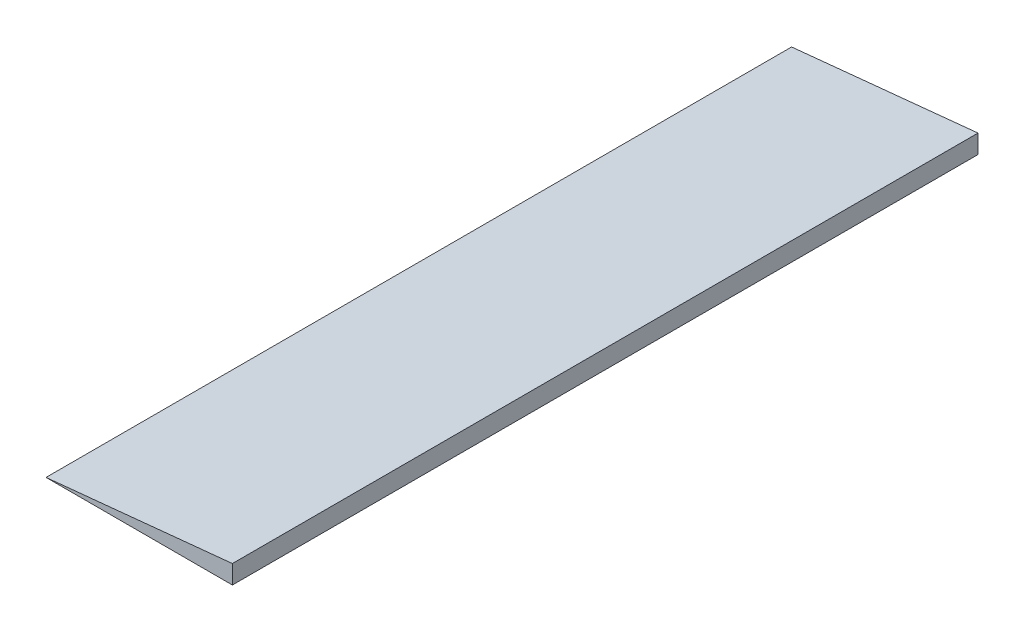
ISO-10303-21;
HEADER;
FILE_DESCRIPTION(('STEP AP214'),'2;1');
FILE_NAME('part.step','',(''),(''),'','','');
FILE_SCHEMA(('AUTOMOTIVE_DESIGN { 1 0 10303 214 1 1 1 1 }'));
ENDSEC;
DATA;
#1=APPLICATION_CONTEXT('core data for automotive mechanical design processes');
#2=APPLICATION_PROTOCOL_DEFINITION('international standard','automotive_design',2000,#1);
#3=PRODUCT_CONTEXT('',#1,'mechanical');
#4=PRODUCT('Part','Part','',(#3));
#5=PRODUCT_RELATED_PRODUCT_CATEGORY('part','',(#4));
#6=PRODUCT_DEFINITION_FORMATION('','',#4);
#7=PRODUCT_DEFINITION_CONTEXT('part definition',#1,'design');
#8=PRODUCT_DEFINITION('design','',#6,#7);
#9=PRODUCT_DEFINITION_SHAPE('','',#8);
#10=(LENGTH_UNIT() NAMED_UNIT(*) SI_UNIT(.MILLI.,.METRE.));
#11=(NAMED_UNIT(*) PLANE_ANGLE_UNIT() SI_UNIT($,.RADIAN.));
#12=(NAMED_UNIT(*) SI_UNIT($,.STERADIAN.) SOLID_ANGLE_UNIT());
#13=UNCERTAINTY_MEASURE_WITH_UNIT(LENGTH_MEASURE(1.E-05),#10,'distance_accuracy_value','');
#14=(GEOMETRIC_REPRESENTATION_CONTEXT(3) GLOBAL_UNCERTAINTY_ASSIGNED_CONTEXT((#13)) GLOBAL_UNIT_ASSIGNED_CONTEXT((#10,
#11,#12)) REPRESENTATION_CONTEXT('',''));
#15=CARTESIAN_POINT('',(0.,0.,0.));
#16=DIRECTION('',(0.,0.,1.));
#17=DIRECTION('',(1.,0.,0.));
#18=AXIS2_PLACEMENT_3D('',#15,#16,#17);
#19=CARTESIAN_POINT('',(0.,100.,0.));
#20=DIRECTION('',(0.,0.,-1.));
#21=DIRECTION('',(-1.,0.,0.));
#22=AXIS2_PLACEMENT_3D('',#19,#20,#21);
#23=PLANE('',#22);
#24=DIRECTION('',(0.,-1.,0.));
#25=VECTOR('',#24,1.);
#26=CARTESIAN_POINT('',(1000.,100.,0.));
#27=LINE('',#26,#25);
#28=CARTESIAN_POINT('',(1000.,100.,0.));
#29=VERTEX_POINT('',#28);
#30=CARTESIAN_POINT('',(1000.,0.,0.));
#31=VERTEX_POINT('',#30);
#32=EDGE_CURVE('E11',#29,#31,#27,.T.);
#33=ORIENTED_EDGE('',*,*,#32,.F.);
#34=DIRECTION('',(0.995037190209989,0.0995037190209989,0.));
#35=VECTOR('',#34,1.);
#36=CARTESIAN_POINT('',(0.,0.,0.));
#37=LINE('',#36,#35);
#38=CARTESIAN_POINT('',(0.,0.,0.));
#39=VERTEX_POINT('',#38);
#40=EDGE_CURVE('E73',#39,#29,#37,.T.);
#41=ORIENTED_EDGE('',*,*,#40,.F.);
#42=DIRECTION('',(1.,0.,0.));
#43=VECTOR('',#42,1.);
#44=CARTESIAN_POINT('',(0.,0.,0.));
#45=LINE('',#44,#43);
#46=EDGE_CURVE('E78',#39,#31,#45,.T.);
#47=ORIENTED_EDGE('',*,*,#46,.T.);
#48=EDGE_LOOP('',(#33,#41,#47));
#49=FACE_BOUND('',#48,.T.);
#50=ADVANCED_FACE('F37',(#49),#23,.F.);
#51=CARTESIAN_POINT('',(1000.,100.,0.));
#52=DIRECTION('',(-1.,0.,0.));
#53=DIRECTION('',(0.,0.,1.));
#54=AXIS2_PLACEMENT_3D('',#51,#52,#53);
#55=PLANE('',#54);
#56=DIRECTION('',(0.,0.,-1.));
#57=VECTOR('',#56,1.);
#58=CARTESIAN_POINT('',(1000.,0.,0.));
#59=LINE('',#58,#57);
#60=CARTESIAN_POINT('',(1000.,0.,-4000.));
#61=VERTEX_POINT('',#60);
#62=EDGE_CURVE('E58',#31,#61,#59,.T.);
#63=ORIENTED_EDGE('',*,*,#62,.T.);
#64=DIRECTION('',(0.,-1.,0.));
#65=VECTOR('',#64,1.);
#66=CARTESIAN_POINT('',(1000.,100.,-4000.));
#67=LINE('',#66,#65);
#68=CARTESIAN_POINT('',(1000.,100.,-4000.));
#69=VERTEX_POINT('',#68);
#70=EDGE_CURVE('E44',#69,#61,#67,.T.);
#71=ORIENTED_EDGE('',*,*,#70,.F.);
#72=DIRECTION('',(0.,0.,-1.));
#73=VECTOR('',#72,1.);
#74=CARTESIAN_POINT('',(1000.,100.,0.));
#75=LINE('',#74,#73);
#76=EDGE_CURVE('E89',#29,#69,#75,.T.);
#77=ORIENTED_EDGE('',*,*,#76,.F.);
#78=ORIENTED_EDGE('',*,*,#32,.T.);
#79=EDGE_LOOP('',(#63,#71,#77,#78));
#80=FACE_BOUND('',#79,.T.);
#81=ADVANCED_FACE('F93',(#80),#55,.F.);
#82=CARTESIAN_POINT('',(0.,100.,-4000.));
#83=DIRECTION('',(0.,0.,1.));
#84=DIRECTION('',(1.,0.,0.));
#85=AXIS2_PLACEMENT_3D('',#82,#83,#84);
#86=PLANE('',#85);
#87=DIRECTION('',(-1.,0.,0.));
#88=VECTOR('',#87,1.);
#89=CARTESIAN_POINT('',(0.,0.,-4000.));
#90=LINE('',#89,#88);
#91=CARTESIAN_POINT('',(0.,0.,-4000.));
#92=VERTEX_POINT('',#91);
#93=EDGE_CURVE('E85',#61,#92,#90,.T.);
#94=ORIENTED_EDGE('',*,*,#93,.T.);
#95=DIRECTION('',(0.995037190209989,0.0995037190209989,0.));
#96=VECTOR('',#95,1.);
#97=CARTESIAN_POINT('',(9.9009900990099,0.990099009900991,-4000.));
#98=LINE('',#97,#96);
#99=EDGE_CURVE('E51',#92,#69,#98,.T.);
#100=ORIENTED_EDGE('',*,*,#99,.T.);
#101=ORIENTED_EDGE('',*,*,#70,.T.);
#102=EDGE_LOOP('',(#94,#100,#101));
#103=FACE_BOUND('',#102,.T.);
#104=ADVANCED_FACE('F92',(#103),#86,.F.);
#105=CARTESIAN_POINT('',(0.,0.,0.));
#106=DIRECTION('',(0.,-1.,0.));
#107=DIRECTION('',(0.,0.,-1.));
#108=AXIS2_PLACEMENT_3D('',#105,#106,#107);
#109=PLANE('',#108);
#110=DIRECTION('',(0.,0.,1.));
#111=VECTOR('',#110,1.);
#112=CARTESIAN_POINT('',(0.,0.,0.));
#113=LINE('',#112,#111);
#114=EDGE_CURVE('E70',#92,#39,#113,.T.);
#115=ORIENTED_EDGE('',*,*,#114,.F.);
#116=ORIENTED_EDGE('',*,*,#93,.F.);
#117=ORIENTED_EDGE('',*,*,#62,.F.);
#118=ORIENTED_EDGE('',*,*,#46,.F.);
#119=EDGE_LOOP('',(#115,#116,#117,#118));
#120=FACE_BOUND('',#119,.T.);
#121=ADVANCED_FACE('F83',(#120),#109,.T.);
#122=CARTESIAN_POINT('',(0.,0.,-5046.));
#123=DIRECTION('',(0.0995037190209989,-0.995037190209989,0.));
#124=DIRECTION('',(0.995037190209989,0.0995037190209989,0.));
#125=AXIS2_PLACEMENT_3D('',#122,#123,#124);
#126=PLANE('',#125);
#127=ORIENTED_EDGE('',*,*,#114,.T.);
#128=ORIENTED_EDGE('',*,*,#40,.T.);
#129=ORIENTED_EDGE('',*,*,#76,.T.);
#130=ORIENTED_EDGE('',*,*,#99,.F.);
#131=EDGE_LOOP('',(#127,#128,#129,#130));
#132=FACE_BOUND('',#131,.T.);
#133=ADVANCED_FACE('F72',(#132),#126,.F.);
#134=CLOSED_SHELL('',(#50,#81,#104,#121,#133));
#135=MANIFOLD_SOLID_BREP('B2',#134);
#136=ADVANCED_BREP_SHAPE_REPRESENTATION('',(#18,#135),#14);
#137=SHAPE_DEFINITION_REPRESENTATION(#9,#136);
ENDSEC;
END-ISO-10303-21;
